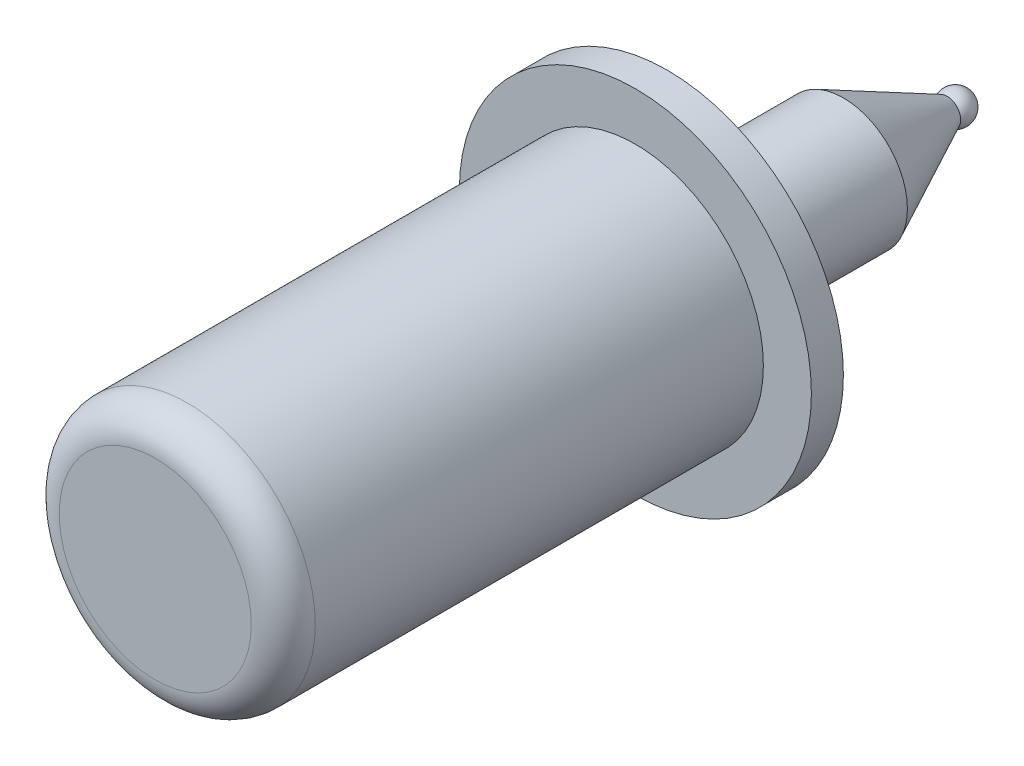
ISO-10303-21;
HEADER;
FILE_DESCRIPTION(('STEP AP214'),'2;1');
FILE_NAME('part.step','',(''),(''),'','','');
FILE_SCHEMA(('AUTOMOTIVE_DESIGN { 1 0 10303 214 1 1 1 1 }'));
ENDSEC;
DATA;
#1=APPLICATION_CONTEXT('core data for automotive mechanical design processes');
#2=APPLICATION_PROTOCOL_DEFINITION('international standard','automotive_design',2000,#1);
#3=PRODUCT_CONTEXT('',#1,'mechanical');
#4=PRODUCT('Part','Part','',(#3));
#5=PRODUCT_RELATED_PRODUCT_CATEGORY('part','',(#4));
#6=PRODUCT_DEFINITION_FORMATION('','',#4);
#7=PRODUCT_DEFINITION_CONTEXT('part definition',#1,'design');
#8=PRODUCT_DEFINITION('design','',#6,#7);
#9=PRODUCT_DEFINITION_SHAPE('','',#8);
#10=(LENGTH_UNIT() NAMED_UNIT(*) SI_UNIT(.MILLI.,.METRE.));
#11=(NAMED_UNIT(*) PLANE_ANGLE_UNIT() SI_UNIT($,.RADIAN.));
#12=(NAMED_UNIT(*) SI_UNIT($,.STERADIAN.) SOLID_ANGLE_UNIT());
#13=UNCERTAINTY_MEASURE_WITH_UNIT(LENGTH_MEASURE(1.E-05),#10,'distance_accuracy_value','');
#14=(GEOMETRIC_REPRESENTATION_CONTEXT(3) GLOBAL_UNCERTAINTY_ASSIGNED_CONTEXT((#13)) GLOBAL_UNIT_ASSIGNED_CONTEXT((#10,
#11,#12)) REPRESENTATION_CONTEXT('',''));
#15=CARTESIAN_POINT('',(0.,0.,0.));
#16=DIRECTION('',(0.,0.,1.));
#17=DIRECTION('',(1.,0.,0.));
#18=AXIS2_PLACEMENT_3D('',#15,#16,#17);
#19=CARTESIAN_POINT('',(0.,0.,-25.));
#20=DIRECTION('',(0.,0.,1.));
#21=DIRECTION('',(0.,-1.,0.));
#22=AXIS2_PLACEMENT_3D('',#19,#20,#21);
#23=SPHERICAL_SURFACE('',#22,0.5);
#24=CARTESIAN_POINT('',(0.,0.,-24.7389715071817));
#25=DIRECTION('',(0.,0.,1.));
#26=DIRECTION('',(1.,0.,0.));
#27=AXIS2_PLACEMENT_3D('',#24,#25,#26);
#28=CIRCLE('',#27,0.426455303563013);
#29=CARTESIAN_POINT('',(0.426455303563013,0.,-24.7389715071817));
#30=VERTEX_POINT('',#29);
#31=EDGE_CURVE('E10',#30,#30,#28,.T.);
#32=ORIENTED_EDGE('',*,*,#31,.F.);
#33=EDGE_LOOP('',(#32));
#34=FACE_BOUND('',#33,.T.);
#35=ADVANCED_FACE('F34',(#34),#23,.T.);
#36=CARTESIAN_POINT('',(0.,0.,-24.7389715071817));
#37=DIRECTION('',(0.,0.,1.));
#38=DIRECTION('',(1.,0.,0.));
#39=AXIS2_PLACEMENT_3D('',#36,#37,#38);
#40=CONICAL_SURFACE('',#39,0.426455303563013,0.452236286108772);
#41=CARTESIAN_POINT('',(0.,0.,-21.5));
#42=DIRECTION('',(0.,0.,1.));
#43=DIRECTION('',(1.,0.,0.));
#44=AXIS2_PLACEMENT_3D('',#41,#42,#43);
#45=CIRCLE('',#44,2.);
#46=CARTESIAN_POINT('',(2.,0.,-21.5));
#47=VERTEX_POINT('',#46);
#48=EDGE_CURVE('E40',#47,#47,#45,.T.);
#49=ORIENTED_EDGE('',*,*,#48,.F.);
#50=EDGE_LOOP('',(#49));
#51=FACE_BOUND('',#50,.T.);
#52=ORIENTED_EDGE('',*,*,#31,.T.);
#53=EDGE_LOOP('',(#52));
#54=FACE_BOUND('',#53,.T.);
#55=ADVANCED_FACE('F100',(#51,#54),#40,.T.);
#56=CARTESIAN_POINT('',(0.,0.,0.));
#57=DIRECTION('',(0.,0.,1.));
#58=DIRECTION('',(1.,0.,0.));
#59=AXIS2_PLACEMENT_3D('',#56,#57,#58);
#60=CYLINDRICAL_SURFACE('',#59,2.);
#61=CARTESIAN_POINT('',(0.,0.,-16.));
#62=DIRECTION('',(0.,0.,1.));
#63=DIRECTION('',(1.,0.,0.));
#64=AXIS2_PLACEMENT_3D('',#61,#62,#63);
#65=CIRCLE('',#64,2.);
#66=CARTESIAN_POINT('',(2.,0.,-16.));
#67=VERTEX_POINT('',#66);
#68=EDGE_CURVE('E44',#67,#67,#65,.T.);
#69=ORIENTED_EDGE('',*,*,#68,.F.);
#70=EDGE_LOOP('',(#69));
#71=FACE_BOUND('',#70,.T.);
#72=ORIENTED_EDGE('',*,*,#48,.T.);
#73=EDGE_LOOP('',(#72));
#74=FACE_BOUND('',#73,.T.);
#75=ADVANCED_FACE('F95',(#71,#74),#60,.T.);
#76=CARTESIAN_POINT('',(0.,5.5,-16.));
#77=DIRECTION('',(0.,0.,1.));
#78=DIRECTION('',(1.,0.,0.));
#79=AXIS2_PLACEMENT_3D('',#76,#77,#78);
#80=PLANE('',#79);
#81=CARTESIAN_POINT('',(0.,0.,-16.));
#82=DIRECTION('',(0.,0.,1.));
#83=DIRECTION('',(1.,0.,0.));
#84=AXIS2_PLACEMENT_3D('',#81,#82,#83);
#85=CIRCLE('',#84,5.5);
#86=CARTESIAN_POINT('',(5.5,0.,-16.));
#87=VERTEX_POINT('',#86);
#88=EDGE_CURVE('E48',#87,#87,#85,.T.);
#89=ORIENTED_EDGE('',*,*,#88,.F.);
#90=EDGE_LOOP('',(#89));
#91=FACE_BOUND('',#90,.T.);
#92=ORIENTED_EDGE('',*,*,#68,.T.);
#93=EDGE_LOOP('',(#92));
#94=FACE_BOUND('',#93,.T.);
#95=ADVANCED_FACE('F89',(#91,#94),#80,.F.);
#96=CARTESIAN_POINT('',(0.,0.,0.));
#97=DIRECTION('',(0.,0.,1.));
#98=DIRECTION('',(1.,0.,0.));
#99=AXIS2_PLACEMENT_3D('',#96,#97,#98);
#100=CYLINDRICAL_SURFACE('',#99,5.5);
#101=CARTESIAN_POINT('',(0.,0.,-15.));
#102=DIRECTION('',(0.,0.,1.));
#103=DIRECTION('',(1.,0.,0.));
#104=AXIS2_PLACEMENT_3D('',#101,#102,#103);
#105=CIRCLE('',#104,5.5);
#106=CARTESIAN_POINT('',(5.5,0.,-15.));
#107=VERTEX_POINT('',#106);
#108=EDGE_CURVE('E53',#107,#107,#105,.T.);
#109=ORIENTED_EDGE('',*,*,#108,.F.);
#110=EDGE_LOOP('',(#109));
#111=FACE_BOUND('',#110,.T.);
#112=ORIENTED_EDGE('',*,*,#88,.T.);
#113=EDGE_LOOP('',(#112));
#114=FACE_BOUND('',#113,.T.);
#115=ADVANCED_FACE('F83',(#111,#114),#100,.T.);
#116=CARTESIAN_POINT('',(0.,4.,-15.));
#117=DIRECTION('',(0.,0.,-1.));
#118=DIRECTION('',(-1.,0.,0.));
#119=AXIS2_PLACEMENT_3D('',#116,#117,#118);
#120=PLANE('',#119);
#121=CARTESIAN_POINT('',(0.,0.,-15.));
#122=DIRECTION('',(0.,0.,1.));
#123=DIRECTION('',(1.,0.,0.));
#124=AXIS2_PLACEMENT_3D('',#121,#122,#123);
#125=CIRCLE('',#124,4.);
#126=CARTESIAN_POINT('',(4.,0.,-15.));
#127=VERTEX_POINT('',#126);
#128=EDGE_CURVE('E56',#127,#127,#125,.T.);
#129=ORIENTED_EDGE('',*,*,#128,.F.);
#130=EDGE_LOOP('',(#129));
#131=FACE_BOUND('',#130,.T.);
#132=ORIENTED_EDGE('',*,*,#108,.T.);
#133=EDGE_LOOP('',(#132));
#134=FACE_BOUND('',#133,.T.);
#135=ADVANCED_FACE('F77',(#131,#134),#120,.F.);
#136=CARTESIAN_POINT('',(0.,0.,0.));
#137=DIRECTION('',(0.,0.,1.));
#138=DIRECTION('',(1.,0.,0.));
#139=AXIS2_PLACEMENT_3D('',#136,#137,#138);
#140=CYLINDRICAL_SURFACE('',#139,4.);
#141=CARTESIAN_POINT('',(0.,0.,-1.));
#142=DIRECTION('',(0.,0.,1.));
#143=DIRECTION('',(1.,0.,0.));
#144=AXIS2_PLACEMENT_3D('',#141,#142,#143);
#145=CIRCLE('',#144,4.);
#146=CARTESIAN_POINT('',(4.,0.,-1.));
#147=VERTEX_POINT('',#146);
#148=EDGE_CURVE('E59',#147,#147,#145,.T.);
#149=ORIENTED_EDGE('',*,*,#148,.F.);
#150=EDGE_LOOP('',(#149));
#151=FACE_BOUND('',#150,.T.);
#152=ORIENTED_EDGE('',*,*,#128,.T.);
#153=EDGE_LOOP('',(#152));
#154=FACE_BOUND('',#153,.T.);
#155=ADVANCED_FACE('F71',(#151,#154),#140,.T.);
#156=CARTESIAN_POINT('',(0.,0.,-1.));
#157=DIRECTION('',(0.,0.,1.));
#158=DIRECTION('',(1.,0.,0.));
#159=AXIS2_PLACEMENT_3D('',#156,#157,#158);
#160=TOROIDAL_SURFACE('',#159,3.,1.);
#161=CARTESIAN_POINT('',(0.,0.,0.));
#162=DIRECTION('',(0.,0.,1.));
#163=DIRECTION('',(1.,0.,0.));
#164=AXIS2_PLACEMENT_3D('',#161,#162,#163);
#165=CIRCLE('',#164,3.);
#166=CARTESIAN_POINT('',(3.,0.,0.));
#167=VERTEX_POINT('',#166);
#168=EDGE_CURVE('E62',#167,#167,#165,.T.);
#169=ORIENTED_EDGE('',*,*,#168,.F.);
#170=EDGE_LOOP('',(#169));
#171=FACE_BOUND('',#170,.T.);
#172=ORIENTED_EDGE('',*,*,#148,.T.);
#173=EDGE_LOOP('',(#172));
#174=FACE_BOUND('',#173,.T.);
#175=ADVANCED_FACE('F68',(#171,#174),#160,.T.);
#176=CARTESIAN_POINT('',(0.,0.,0.));
#177=DIRECTION('',(0.,0.,-1.));
#178=DIRECTION('',(-1.,0.,0.));
#179=AXIS2_PLACEMENT_3D('',#176,#177,#178);
#180=PLANE('',#179);
#181=ORIENTED_EDGE('',*,*,#168,.T.);
#182=EDGE_LOOP('',(#181));
#183=FACE_BOUND('',#182,.T.);
#184=ADVANCED_FACE('F66',(#183),#180,.F.);
#185=CLOSED_SHELL('',(#35,#55,#75,#95,#115,#135,#155,#175,#184));
#186=MANIFOLD_SOLID_BREP('B2',#185);
#187=ADVANCED_BREP_SHAPE_REPRESENTATION('',(#18,#186),#14);
#188=SHAPE_DEFINITION_REPRESENTATION(#9,#187);
ENDSEC;
END-ISO-10303-21;
